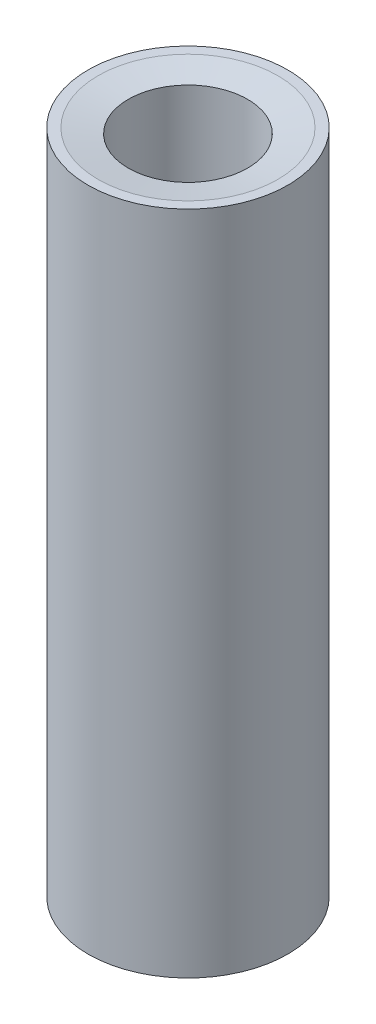
ISO-10303-21;
HEADER;
FILE_DESCRIPTION(('STEP AP214'),'2;1');
FILE_NAME('part.step','',(''),(''),'','','');
FILE_SCHEMA(('AUTOMOTIVE_DESIGN { 1 0 10303 214 1 1 1 1 }'));
ENDSEC;
DATA;
#1=APPLICATION_CONTEXT('core data for automotive mechanical design processes');
#2=APPLICATION_PROTOCOL_DEFINITION('international standard','automotive_design',2000,#1);
#3=PRODUCT_CONTEXT('',#1,'mechanical');
#4=PRODUCT('Part','Part','',(#3));
#5=PRODUCT_RELATED_PRODUCT_CATEGORY('part','',(#4));
#6=PRODUCT_DEFINITION_FORMATION('','',#4);
#7=PRODUCT_DEFINITION_CONTEXT('part definition',#1,'design');
#8=PRODUCT_DEFINITION('design','',#6,#7);
#9=PRODUCT_DEFINITION_SHAPE('','',#8);
#10=(LENGTH_UNIT() NAMED_UNIT(*) SI_UNIT(.MILLI.,.METRE.));
#11=(NAMED_UNIT(*) PLANE_ANGLE_UNIT() SI_UNIT($,.RADIAN.));
#12=(NAMED_UNIT(*) SI_UNIT($,.STERADIAN.) SOLID_ANGLE_UNIT());
#13=UNCERTAINTY_MEASURE_WITH_UNIT(LENGTH_MEASURE(1.E-05),#10,'distance_accuracy_value','');
#14=(GEOMETRIC_REPRESENTATION_CONTEXT(3) GLOBAL_UNCERTAINTY_ASSIGNED_CONTEXT((#13)) GLOBAL_UNIT_ASSIGNED_CONTEXT((#10,
#11,#12)) REPRESENTATION_CONTEXT('',''));
#15=CARTESIAN_POINT('',(0.,0.,0.));
#16=DIRECTION('',(0.,0.,1.));
#17=DIRECTION('',(1.,0.,0.));
#18=AXIS2_PLACEMENT_3D('',#15,#16,#17);
#19=CARTESIAN_POINT('',(0.,15.875,0.));
#20=DIRECTION('',(0.,-1.,0.));
#21=DIRECTION('',(0.,0.,-1.));
#22=AXIS2_PLACEMENT_3D('',#19,#20,#21);
#23=CYLINDRICAL_SURFACE('',#22,2.38125);
#24=CARTESIAN_POINT('',(0.,15.875,0.));
#25=DIRECTION('',(0.,1.,0.));
#26=DIRECTION('',(0.,0.,1.));
#27=AXIS2_PLACEMENT_3D('',#24,#25,#26);
#28=CIRCLE('',#27,2.38125);
#29=CARTESIAN_POINT('',(0.,15.875,2.38125));
#30=VERTEX_POINT('',#29);
#31=EDGE_CURVE('E40',#30,#30,#28,.T.);
#32=ORIENTED_EDGE('',*,*,#31,.F.);
#33=EDGE_LOOP('',(#32));
#34=FACE_BOUND('',#33,.T.);
#35=CARTESIAN_POINT('',(0.,0.,0.));
#36=DIRECTION('',(0.,1.,0.));
#37=DIRECTION('',(0.,0.,1.));
#38=AXIS2_PLACEMENT_3D('',#35,#36,#37);
#39=CIRCLE('',#38,2.38125);
#40=CARTESIAN_POINT('',(0.,0.,2.38125));
#41=VERTEX_POINT('',#40);
#42=EDGE_CURVE('E44',#41,#41,#39,.T.);
#43=ORIENTED_EDGE('',*,*,#42,.T.);
#44=EDGE_LOOP('',(#43));
#45=FACE_BOUND('',#44,.T.);
#46=ADVANCED_FACE('F29',(#34,#45),#23,.T.);
#47=CARTESIAN_POINT('',(0.,15.875,0.));
#48=DIRECTION('',(0.,1.,0.));
#49=DIRECTION('',(0.,0.,1.));
#50=AXIS2_PLACEMENT_3D('',#47,#48,#49);
#51=PLANE('',#50);
#52=CARTESIAN_POINT('',(0.,15.875,0.));
#53=DIRECTION('',(0.,1.,0.));
#54=DIRECTION('',(0.,0.,1.));
#55=AXIS2_PLACEMENT_3D('',#52,#53,#54);
#56=CIRCLE('',#55,2.14265279109077);
#57=CARTESIAN_POINT('',(0.,15.875,2.14265279109077));
#58=VERTEX_POINT('',#57);
#59=EDGE_CURVE('E10',#58,#58,#56,.F.);
#60=ORIENTED_EDGE('',*,*,#59,.T.);
#61=EDGE_LOOP('',(#60));
#62=FACE_BOUND('',#61,.T.);
#63=ORIENTED_EDGE('',*,*,#31,.T.);
#64=EDGE_LOOP('',(#63));
#65=FACE_BOUND('',#64,.T.);
#66=ADVANCED_FACE('F88',(#62,#65),#51,.T.);
#67=CARTESIAN_POINT('',(0.,0.,0.));
#68=DIRECTION('',(0.,1.,0.));
#69=DIRECTION('',(0.,0.,1.));
#70=AXIS2_PLACEMENT_3D('',#67,#68,#69);
#71=PLANE('',#70);
#72=CARTESIAN_POINT('',(0.,-1.2490009027033E-13,0.));
#73=DIRECTION('',(0.,-1.,0.));
#74=DIRECTION('',(0.,0.,-1.));
#75=AXIS2_PLACEMENT_3D('',#72,#73,#74);
#76=CIRCLE('',#75,1.42240000000005);
#77=CARTESIAN_POINT('',(0.,-1.2490009027033E-13,-1.42240000000005));
#78=VERTEX_POINT('',#77);
#79=EDGE_CURVE('E50',#78,#78,#76,.T.);
#80=ORIENTED_EDGE('',*,*,#79,.F.);
#81=EDGE_LOOP('',(#80));
#82=FACE_BOUND('',#81,.T.);
#83=ORIENTED_EDGE('',*,*,#42,.F.);
#84=EDGE_LOOP('',(#83));
#85=FACE_BOUND('',#84,.T.);
#86=ADVANCED_FACE('F93',(#82,#85),#71,.F.);
#87=CARTESIAN_POINT('',(0.,7.62,0.));
#88=DIRECTION('',(0.,-1.,0.));
#89=DIRECTION('',(0.,0.,-1.));
#90=AXIS2_PLACEMENT_3D('',#87,#88,#89);
#91=CONICAL_SURFACE('',#90,1.1303,1.02974425867665);
#92=CARTESIAN_POINT('',(0.,7.9375,0.));
#93=DIRECTION('',(0.,1.,0.));
#94=DIRECTION('',(0.,0.,1.));
#95=AXIS2_PLACEMENT_3D('',#92,#93,#94);
#96=CIRCLE('',#95,0.60189126435371);
#97=CARTESIAN_POINT('',(0.,7.9375,0.60189126435371));
#98=VERTEX_POINT('',#97);
#99=EDGE_CURVE('E47',#98,#98,#96,.T.);
#100=ORIENTED_EDGE('',*,*,#99,.T.);
#101=EDGE_LOOP('',(#100));
#102=FACE_BOUND('',#101,.T.);
#103=CARTESIAN_POINT('',(0.,7.62,0.));
#104=DIRECTION('',(0.,-1.,0.));
#105=DIRECTION('',(0.,0.,-1.));
#106=AXIS2_PLACEMENT_3D('',#103,#104,#105);
#107=CIRCLE('',#106,1.1303);
#108=CARTESIAN_POINT('',(0.,7.62,-1.1303));
#109=VERTEX_POINT('',#108);
#110=EDGE_CURVE('E53',#109,#109,#107,.T.);
#111=ORIENTED_EDGE('',*,*,#110,.T.);
#112=EDGE_LOOP('',(#111));
#113=FACE_BOUND('',#112,.T.);
#114=ADVANCED_FACE('F99',(#102,#113),#91,.F.);
#115=CARTESIAN_POINT('',(0.,0.,0.));
#116=DIRECTION('',(0.,-1.,0.));
#117=DIRECTION('',(0.,0.,-1.));
#118=AXIS2_PLACEMENT_3D('',#115,#116,#117);
#119=CYLINDRICAL_SURFACE('',#118,1.1303);
#120=ORIENTED_EDGE('',*,*,#110,.F.);
#121=EDGE_LOOP('',(#120));
#122=FACE_BOUND('',#121,.T.);
#123=CARTESIAN_POINT('',(0.,5.588,0.));
#124=DIRECTION('',(0.,-1.,0.));
#125=DIRECTION('',(0.,0.,-1.));
#126=AXIS2_PLACEMENT_3D('',#123,#124,#125);
#127=CIRCLE('',#126,1.1303);
#128=CARTESIAN_POINT('',(0.,5.588,-1.1303));
#129=VERTEX_POINT('',#128);
#130=EDGE_CURVE('E57',#129,#129,#127,.T.);
#131=ORIENTED_EDGE('',*,*,#130,.T.);
#132=EDGE_LOOP('',(#131));
#133=FACE_BOUND('',#132,.T.);
#134=ADVANCED_FACE('F104',(#122,#133),#119,.F.);
#135=CARTESIAN_POINT('',(1.1303,5.588,0.));
#136=DIRECTION('',(0.,1.,0.));
#137=DIRECTION('',(0.,0.,1.));
#138=AXIS2_PLACEMENT_3D('',#135,#136,#137);
#139=PLANE('',#138);
#140=ORIENTED_EDGE('',*,*,#130,.F.);
#141=EDGE_LOOP('',(#140));
#142=FACE_BOUND('',#141,.T.);
#143=CARTESIAN_POINT('',(0.,5.588,0.));
#144=DIRECTION('',(0.,-1.,0.));
#145=DIRECTION('',(0.,0.,-1.));
#146=AXIS2_PLACEMENT_3D('',#143,#144,#145);
#147=CIRCLE('',#146,1.4224);
#148=CARTESIAN_POINT('',(0.,5.588,-1.4224));
#149=VERTEX_POINT('',#148);
#150=EDGE_CURVE('E60',#149,#149,#147,.T.);
#151=ORIENTED_EDGE('',*,*,#150,.T.);
#152=EDGE_LOOP('',(#151));
#153=FACE_BOUND('',#152,.T.);
#154=ADVANCED_FACE('F108',(#142,#153),#139,.F.);
#155=CARTESIAN_POINT('',(0.,0.,0.));
#156=DIRECTION('',(0.,-1.,0.));
#157=DIRECTION('',(0.,0.,-1.));
#158=AXIS2_PLACEMENT_3D('',#155,#156,#157);
#159=CYLINDRICAL_SURFACE('',#158,1.42240000000002);
#160=ORIENTED_EDGE('',*,*,#150,.F.);
#161=EDGE_LOOP('',(#160));
#162=FACE_BOUND('',#161,.T.);
#163=ORIENTED_EDGE('',*,*,#79,.T.);
#164=EDGE_LOOP('',(#163));
#165=FACE_BOUND('',#164,.T.);
#166=ADVANCED_FACE('F112',(#162,#165),#159,.F.);
#167=CARTESIAN_POINT('',(0.,8.255,0.));
#168=DIRECTION('',(0.,1.,0.));
#169=DIRECTION('',(0.,0.,1.));
#170=AXIS2_PLACEMENT_3D('',#167,#168,#169);
#171=CONICAL_SURFACE('',#170,1.1303,1.02974425867665);
#172=CARTESIAN_POINT('',(0.,8.255,0.));
#173=DIRECTION('',(0.,1.,0.));
#174=DIRECTION('',(0.,0.,1.));
#175=AXIS2_PLACEMENT_3D('',#172,#173,#174);
#176=CIRCLE('',#175,1.1303);
#177=CARTESIAN_POINT('',(0.,8.255,1.1303));
#178=VERTEX_POINT('',#177);
#179=EDGE_CURVE('E51',#178,#178,#176,.T.);
#180=ORIENTED_EDGE('',*,*,#179,.T.);
#181=EDGE_LOOP('',(#180));
#182=FACE_BOUND('',#181,.T.);
#183=ORIENTED_EDGE('',*,*,#99,.F.);
#184=EDGE_LOOP('',(#183));
#185=FACE_BOUND('',#184,.T.);
#186=ADVANCED_FACE('F116',(#182,#185),#171,.F.);
#187=CARTESIAN_POINT('',(0.,15.875,0.));
#188=DIRECTION('',(0.,1.,0.));
#189=DIRECTION('',(0.,0.,1.));
#190=AXIS2_PLACEMENT_3D('',#187,#188,#189);
#191=CYLINDRICAL_SURFACE('',#190,1.1303);
#192=ORIENTED_EDGE('',*,*,#179,.F.);
#193=EDGE_LOOP('',(#192));
#194=FACE_BOUND('',#193,.T.);
#195=CARTESIAN_POINT('',(0.,10.287,0.));
#196=DIRECTION('',(0.,1.,0.));
#197=DIRECTION('',(0.,0.,1.));
#198=AXIS2_PLACEMENT_3D('',#195,#196,#197);
#199=CIRCLE('',#198,1.1303);
#200=CARTESIAN_POINT('',(0.,10.287,1.1303));
#201=VERTEX_POINT('',#200);
#202=EDGE_CURVE('E67',#201,#201,#199,.T.);
#203=ORIENTED_EDGE('',*,*,#202,.T.);
#204=EDGE_LOOP('',(#203));
#205=FACE_BOUND('',#204,.T.);
#206=ADVANCED_FACE('F84',(#194,#205),#191,.F.);
#207=CARTESIAN_POINT('',(1.1303,10.287,0.));
#208=DIRECTION('',(0.,-1.,0.));
#209=DIRECTION('',(0.,0.,-1.));
#210=AXIS2_PLACEMENT_3D('',#207,#208,#209);
#211=PLANE('',#210);
#212=ORIENTED_EDGE('',*,*,#202,.F.);
#213=EDGE_LOOP('',(#212));
#214=FACE_BOUND('',#213,.T.);
#215=CARTESIAN_POINT('',(0.,10.287,0.));
#216=DIRECTION('',(0.,1.,0.));
#217=DIRECTION('',(0.,0.,1.));
#218=AXIS2_PLACEMENT_3D('',#215,#216,#217);
#219=CIRCLE('',#218,1.4224);
#220=CARTESIAN_POINT('',(0.,10.287,1.4224));
#221=VERTEX_POINT('',#220);
#222=EDGE_CURVE('E70',#221,#221,#219,.T.);
#223=ORIENTED_EDGE('',*,*,#222,.T.);
#224=EDGE_LOOP('',(#223));
#225=FACE_BOUND('',#224,.T.);
#226=ADVANCED_FACE('F74',(#214,#225),#211,.F.);
#227=CARTESIAN_POINT('',(0.,15.875,0.));
#228=DIRECTION('',(0.,1.,0.));
#229=DIRECTION('',(0.,0.,1.));
#230=AXIS2_PLACEMENT_3D('',#227,#228,#229);
#231=CYLINDRICAL_SURFACE('',#230,1.42240000000002);
#232=CARTESIAN_POINT('',(0.,15.7480000000001,0.));
#233=DIRECTION('',(0.,1.,0.));
#234=DIRECTION('',(0.,0.,1.));
#235=AXIS2_PLACEMENT_3D('',#232,#233,#234);
#236=CIRCLE('',#235,1.42240000000002);
#237=CARTESIAN_POINT('',(0.,15.7480000000001,1.42240000000002));
#238=VERTEX_POINT('',#237);
#239=EDGE_CURVE('E36',#238,#238,#236,.T.);
#240=ORIENTED_EDGE('',*,*,#239,.T.);
#241=EDGE_LOOP('',(#240));
#242=FACE_BOUND('',#241,.T.);
#243=ORIENTED_EDGE('',*,*,#222,.F.);
#244=EDGE_LOOP('',(#243));
#245=FACE_BOUND('',#244,.T.);
#246=ADVANCED_FACE('F76',(#242,#245),#231,.F.);
#247=CARTESIAN_POINT('',(0.,15.7480000000001,0.));
#248=DIRECTION('',(0.,1.,0.));
#249=DIRECTION('',(0.,0.,1.));
#250=AXIS2_PLACEMENT_3D('',#247,#248,#249);
#251=CONICAL_SURFACE('',#250,1.42240000000002,1.39626340159546);
#252=ORIENTED_EDGE('',*,*,#59,.F.);
#253=EDGE_LOOP('',(#252));
#254=FACE_BOUND('',#253,.T.);
#255=ORIENTED_EDGE('',*,*,#239,.F.);
#256=EDGE_LOOP('',(#255));
#257=FACE_BOUND('',#256,.T.);
#258=ADVANCED_FACE('F31',(#254,#257),#251,.F.);
#259=CLOSED_SHELL('',(#46,#66,#86,#114,#134,#154,#166,#186,#206,#226,#246,#258));
#260=MANIFOLD_SOLID_BREP('B2',#259);
#261=ADVANCED_BREP_SHAPE_REPRESENTATION('',(#18,#260),#14);
#262=SHAPE_DEFINITION_REPRESENTATION(#9,#261);
ENDSEC;
END-ISO-10303-21;
